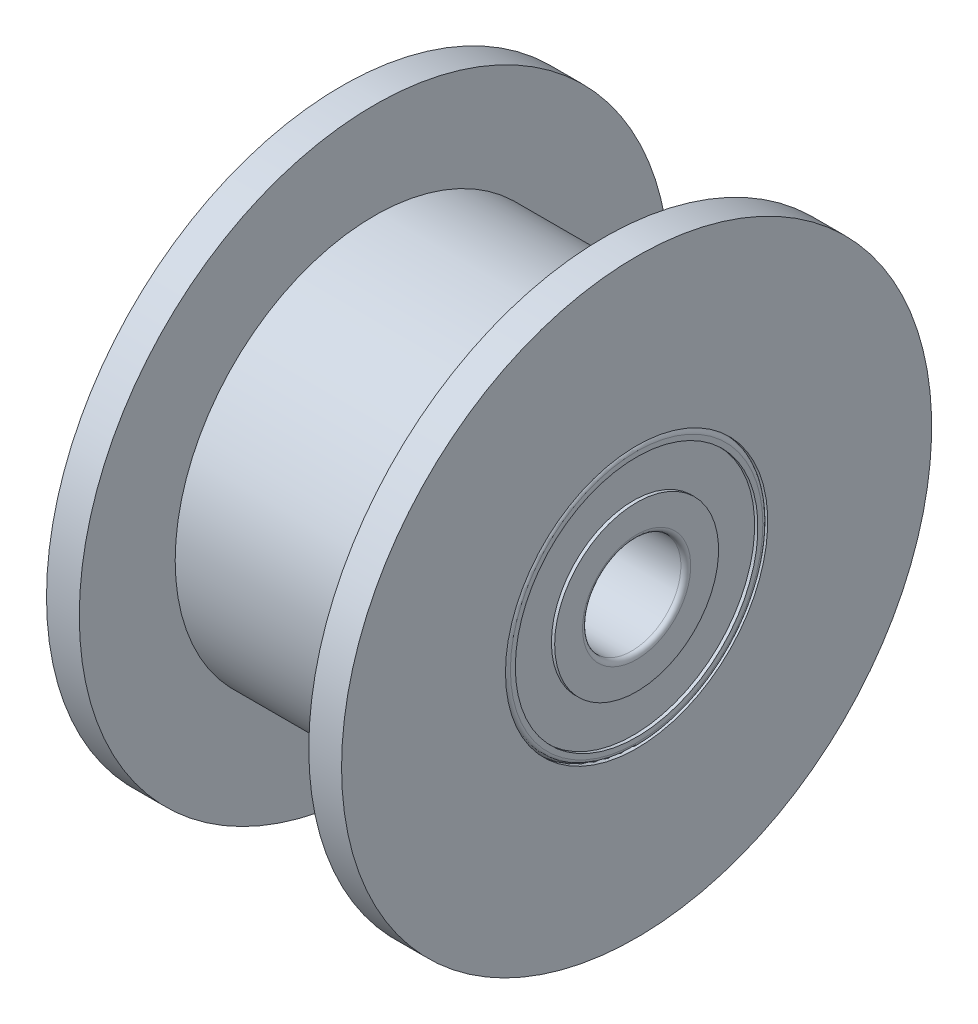
ISO-10303-21;
HEADER;
FILE_DESCRIPTION(('STEP AP214'),'2;1');
FILE_NAME('part.step','',(''),(''),'','','');
FILE_SCHEMA(('AUTOMOTIVE_DESIGN { 1 0 10303 214 1 1 1 1 }'));
ENDSEC;
DATA;
#1=APPLICATION_CONTEXT('core data for automotive mechanical design processes');
#2=APPLICATION_PROTOCOL_DEFINITION('international standard','automotive_design',2000,#1);
#3=PRODUCT_CONTEXT('',#1,'mechanical');
#4=PRODUCT('Part','Part','',(#3));
#5=PRODUCT_RELATED_PRODUCT_CATEGORY('part','',(#4));
#6=PRODUCT_DEFINITION_FORMATION('','',#4);
#7=PRODUCT_DEFINITION_CONTEXT('part definition',#1,'design');
#8=PRODUCT_DEFINITION('design','',#6,#7);
#9=PRODUCT_DEFINITION_SHAPE('','',#8);
#10=(LENGTH_UNIT() NAMED_UNIT(*) SI_UNIT(.MILLI.,.METRE.));
#11=(NAMED_UNIT(*) PLANE_ANGLE_UNIT() SI_UNIT($,.RADIAN.));
#12=(NAMED_UNIT(*) SI_UNIT($,.STERADIAN.) SOLID_ANGLE_UNIT());
#13=UNCERTAINTY_MEASURE_WITH_UNIT(LENGTH_MEASURE(1.E-05),#10,'distance_accuracy_value','');
#14=(GEOMETRIC_REPRESENTATION_CONTEXT(3) GLOBAL_UNCERTAINTY_ASSIGNED_CONTEXT((#13)) GLOBAL_UNIT_ASSIGNED_CONTEXT((#10,
#11,#12)) REPRESENTATION_CONTEXT('',''));
#15=CARTESIAN_POINT('',(0.,0.,0.));
#16=DIRECTION('',(0.,0.,1.));
#17=DIRECTION('',(1.,0.,0.));
#18=AXIS2_PLACEMENT_3D('',#15,#16,#17);
#19=CARTESIAN_POINT('',(-4.35,0.,0.));
#20=DIRECTION('',(1.,0.,0.));
#21=DIRECTION('',(0.,0.,1.));
#22=AXIS2_PLACEMENT_3D('',#19,#20,#21);
#23=TOROIDAL_SURFACE('',#22,1.65,0.15);
#24=CARTESIAN_POINT('',(-4.5,0.,0.));
#25=DIRECTION('',(-1.,0.,0.));
#26=DIRECTION('',(0.,0.,1.));
#27=AXIS2_PLACEMENT_3D('',#24,#25,#26);
#28=CIRCLE('',#27,1.65);
#29=CARTESIAN_POINT('',(-4.5,0.,1.65));
#30=VERTEX_POINT('',#29);
#31=EDGE_CURVE('E165',#30,#30,#28,.T.);
#32=ORIENTED_EDGE('',*,*,#31,.T.);
#33=EDGE_LOOP('',(#32));
#34=FACE_BOUND('',#33,.T.);
#35=CARTESIAN_POINT('',(-4.35,0.,0.));
#36=DIRECTION('',(1.,0.,0.));
#37=DIRECTION('',(0.,0.,1.));
#38=AXIS2_PLACEMENT_3D('',#35,#36,#37);
#39=CIRCLE('',#38,1.5);
#40=CARTESIAN_POINT('',(-4.35,0.,1.5));
#41=VERTEX_POINT('',#40);
#42=EDGE_CURVE('E162',#41,#41,#39,.T.);
#43=ORIENTED_EDGE('',*,*,#42,.T.);
#44=EDGE_LOOP('',(#43));
#45=FACE_BOUND('',#44,.T.);
#46=ADVANCED_FACE('F15',(#34,#45),#23,.T.);
#47=CARTESIAN_POINT('',(-4.5,0.,6.5));
#48=DIRECTION('',(1.,0.,0.));
#49=DIRECTION('',(0.,1.,0.));
#50=AXIS2_PLACEMENT_3D('',#47,#48,#49);
#51=PLANE('',#50);
#52=CARTESIAN_POINT('',(-4.5,0.,0.));
#53=DIRECTION('',(-1.,0.,0.));
#54=DIRECTION('',(0.,0.,1.));
#55=AXIS2_PLACEMENT_3D('',#52,#53,#54);
#56=CIRCLE('',#55,4.);
#57=CARTESIAN_POINT('',(-4.5,0.,4.));
#58=VERTEX_POINT('',#57);
#59=EDGE_CURVE('E10',#58,#58,#56,.T.);
#60=ORIENTED_EDGE('',*,*,#59,.F.);
#61=EDGE_LOOP('',(#60));
#62=FACE_BOUND('',#61,.T.);
#63=CARTESIAN_POINT('',(-4.5,0.,0.));
#64=DIRECTION('',(-1.,0.,0.));
#65=DIRECTION('',(0.,0.,1.));
#66=AXIS2_PLACEMENT_3D('',#63,#64,#65);
#67=CIRCLE('',#66,9.);
#68=CARTESIAN_POINT('',(-4.5,0.,9.));
#69=VERTEX_POINT('',#68);
#70=EDGE_CURVE('E193',#69,#69,#67,.T.);
#71=ORIENTED_EDGE('',*,*,#70,.T.);
#72=EDGE_LOOP('',(#71));
#73=FACE_BOUND('',#72,.T.);
#74=ADVANCED_FACE('F243',(#62,#73),#51,.F.);
#75=CARTESIAN_POINT('',(-2.25,0.,0.));
#76=DIRECTION('',(1.,0.,0.));
#77=DIRECTION('',(0.,0.,1.));
#78=AXIS2_PLACEMENT_3D('',#75,#76,#77);
#79=CYLINDRICAL_SURFACE('',#78,4.);
#80=CARTESIAN_POINT('',(-4.35,0.,0.));
#81=DIRECTION('',(-1.,0.,0.));
#82=DIRECTION('',(0.,0.,1.));
#83=AXIS2_PLACEMENT_3D('',#80,#81,#82);
#84=CIRCLE('',#83,4.);
#85=CARTESIAN_POINT('',(-4.35,0.,4.));
#86=VERTEX_POINT('',#85);
#87=EDGE_CURVE('E26',#86,#86,#84,.T.);
#88=ORIENTED_EDGE('',*,*,#87,.F.);
#89=EDGE_LOOP('',(#88));
#90=FACE_BOUND('',#89,.T.);
#91=ORIENTED_EDGE('',*,*,#59,.T.);
#92=EDGE_LOOP('',(#91));
#93=FACE_BOUND('',#92,.T.);
#94=ADVANCED_FACE('F232',(#90,#93),#79,.F.);
#95=CARTESIAN_POINT('',(-4.35,0.,0.));
#96=DIRECTION('',(1.,0.,0.));
#97=DIRECTION('',(0.,0.,1.));
#98=AXIS2_PLACEMENT_3D('',#95,#96,#97);
#99=TOROIDAL_SURFACE('',#98,3.85,0.15);
#100=ORIENTED_EDGE('',*,*,#87,.T.);
#101=EDGE_LOOP('',(#100));
#102=FACE_BOUND('',#101,.T.);
#103=CARTESIAN_POINT('',(-4.5,0.,0.));
#104=DIRECTION('',(-1.,0.,0.));
#105=DIRECTION('',(0.,0.,1.));
#106=AXIS2_PLACEMENT_3D('',#103,#104,#105);
#107=CIRCLE('',#106,3.85);
#108=CARTESIAN_POINT('',(-4.5,0.,3.85));
#109=VERTEX_POINT('',#108);
#110=EDGE_CURVE('E152',#109,#109,#107,.T.);
#111=ORIENTED_EDGE('',*,*,#110,.F.);
#112=EDGE_LOOP('',(#111));
#113=FACE_BOUND('',#112,.T.);
#114=ADVANCED_FACE('F230',(#102,#113),#99,.T.);
#115=CARTESIAN_POINT('',(-4.5,0.,3.775));
#116=DIRECTION('',(1.,0.,0.));
#117=DIRECTION('',(0.,1.,0.));
#118=AXIS2_PLACEMENT_3D('',#115,#116,#117);
#119=PLANE('',#118);
#120=CARTESIAN_POINT('',(-4.5,0.,0.));
#121=DIRECTION('',(-1.,0.,0.));
#122=DIRECTION('',(0.,0.,1.));
#123=AXIS2_PLACEMENT_3D('',#120,#121,#122);
#124=CIRCLE('',#123,3.7);
#125=CARTESIAN_POINT('',(-4.5,0.,3.7));
#126=VERTEX_POINT('',#125);
#127=EDGE_CURVE('E144',#126,#126,#124,.T.);
#128=ORIENTED_EDGE('',*,*,#127,.F.);
#129=EDGE_LOOP('',(#128));
#130=FACE_BOUND('',#129,.T.);
#131=ORIENTED_EDGE('',*,*,#110,.T.);
#132=EDGE_LOOP('',(#131));
#133=FACE_BOUND('',#132,.T.);
#134=ADVANCED_FACE('F228',(#130,#133),#119,.F.);
#135=CARTESIAN_POINT('',(-2.25,0.,0.));
#136=DIRECTION('',(1.,0.,0.));
#137=DIRECTION('',(0.,0.,1.));
#138=AXIS2_PLACEMENT_3D('',#135,#136,#137);
#139=CYLINDRICAL_SURFACE('',#138,3.7);
#140=CARTESIAN_POINT('',(-4.4,0.,0.));
#141=DIRECTION('',(-1.,0.,0.));
#142=DIRECTION('',(0.,0.,1.));
#143=AXIS2_PLACEMENT_3D('',#140,#141,#142);
#144=CIRCLE('',#143,3.7);
#145=CARTESIAN_POINT('',(-4.4,0.,3.7));
#146=VERTEX_POINT('',#145);
#147=EDGE_CURVE('E140',#146,#146,#144,.T.);
#148=ORIENTED_EDGE('',*,*,#147,.F.);
#149=EDGE_LOOP('',(#148));
#150=FACE_BOUND('',#149,.T.);
#151=ORIENTED_EDGE('',*,*,#127,.T.);
#152=EDGE_LOOP('',(#151));
#153=FACE_BOUND('',#152,.T.);
#154=ADVANCED_FACE('F240',(#150,#153),#139,.F.);
#155=CARTESIAN_POINT('',(-4.4,0.,3.1));
#156=DIRECTION('',(1.,0.,0.));
#157=DIRECTION('',(0.,1.,0.));
#158=AXIS2_PLACEMENT_3D('',#155,#156,#157);
#159=PLANE('',#158);
#160=CARTESIAN_POINT('',(-4.4,0.,0.));
#161=DIRECTION('',(-1.,0.,0.));
#162=DIRECTION('',(0.,0.,1.));
#163=AXIS2_PLACEMENT_3D('',#160,#161,#162);
#164=CIRCLE('',#163,2.5);
#165=CARTESIAN_POINT('',(-4.4,0.,2.5));
#166=VERTEX_POINT('',#165);
#167=EDGE_CURVE('E145',#166,#166,#164,.T.);
#168=ORIENTED_EDGE('',*,*,#167,.F.);
#169=EDGE_LOOP('',(#168));
#170=FACE_BOUND('',#169,.T.);
#171=ORIENTED_EDGE('',*,*,#147,.T.);
#172=EDGE_LOOP('',(#171));
#173=FACE_BOUND('',#172,.T.);
#174=ADVANCED_FACE('F141',(#170,#173),#159,.F.);
#175=CARTESIAN_POINT('',(-2.25,0.,0.));
#176=DIRECTION('',(1.,0.,0.));
#177=DIRECTION('',(0.,0.,1.));
#178=AXIS2_PLACEMENT_3D('',#175,#176,#177);
#179=CYLINDRICAL_SURFACE('',#178,2.5);
#180=CARTESIAN_POINT('',(-4.5,0.,0.));
#181=DIRECTION('',(-1.,0.,0.));
#182=DIRECTION('',(0.,0.,1.));
#183=AXIS2_PLACEMENT_3D('',#180,#181,#182);
#184=CIRCLE('',#183,2.5);
#185=CARTESIAN_POINT('',(-4.5,0.,2.5));
#186=VERTEX_POINT('',#185);
#187=EDGE_CURVE('E154',#186,#186,#184,.T.);
#188=ORIENTED_EDGE('',*,*,#187,.F.);
#189=EDGE_LOOP('',(#188));
#190=FACE_BOUND('',#189,.T.);
#191=ORIENTED_EDGE('',*,*,#167,.T.);
#192=EDGE_LOOP('',(#191));
#193=FACE_BOUND('',#192,.T.);
#194=ADVANCED_FACE('F271',(#190,#193),#179,.T.);
#195=CARTESIAN_POINT('',(-4.5,0.,2.));
#196=DIRECTION('',(1.,0.,0.));
#197=DIRECTION('',(0.,1.,0.));
#198=AXIS2_PLACEMENT_3D('',#195,#196,#197);
#199=PLANE('',#198);
#200=ORIENTED_EDGE('',*,*,#187,.T.);
#201=EDGE_LOOP('',(#200));
#202=FACE_BOUND('',#201,.T.);
#203=ORIENTED_EDGE('',*,*,#31,.F.);
#204=EDGE_LOOP('',(#203));
#205=FACE_BOUND('',#204,.T.);
#206=ADVANCED_FACE('F308',(#202,#205),#199,.F.);
#207=CARTESIAN_POINT('',(-2.25,0.,0.));
#208=DIRECTION('',(1.,0.,0.));
#209=DIRECTION('',(0.,0.,1.));
#210=AXIS2_PLACEMENT_3D('',#207,#208,#209);
#211=CYLINDRICAL_SURFACE('',#210,1.5);
#212=CARTESIAN_POINT('',(-1.5,0.,0.));
#213=DIRECTION('',(-1.,0.,0.));
#214=DIRECTION('',(0.,0.,1.));
#215=AXIS2_PLACEMENT_3D('',#212,#213,#214);
#216=CIRCLE('',#215,1.5);
#217=CARTESIAN_POINT('',(-1.5,0.,1.5));
#218=VERTEX_POINT('',#217);
#219=EDGE_CURVE('E166',#218,#218,#216,.T.);
#220=ORIENTED_EDGE('',*,*,#219,.F.);
#221=EDGE_LOOP('',(#220));
#222=FACE_BOUND('',#221,.T.);
#223=ORIENTED_EDGE('',*,*,#42,.F.);
#224=EDGE_LOOP('',(#223));
#225=FACE_BOUND('',#224,.T.);
#226=ADVANCED_FACE('F284',(#222,#225),#211,.F.);
#227=CARTESIAN_POINT('',(-1.5,0.,2.625));
#228=DIRECTION('',(1.,0.,0.));
#229=DIRECTION('',(0.,1.,0.));
#230=AXIS2_PLACEMENT_3D('',#227,#228,#229);
#231=PLANE('',#230);
#232=ORIENTED_EDGE('',*,*,#219,.T.);
#233=EDGE_LOOP('',(#232));
#234=FACE_BOUND('',#233,.T.);
#235=CARTESIAN_POINT('',(-1.5,0.,0.));
#236=DIRECTION('',(-1.,0.,0.));
#237=DIRECTION('',(0.,0.,1.));
#238=AXIS2_PLACEMENT_3D('',#235,#236,#237);
#239=CIRCLE('',#238,3.75);
#240=CARTESIAN_POINT('',(-1.5,0.,3.75));
#241=VERTEX_POINT('',#240);
#242=EDGE_CURVE('E170',#241,#241,#239,.T.);
#243=ORIENTED_EDGE('',*,*,#242,.F.);
#244=EDGE_LOOP('',(#243));
#245=FACE_BOUND('',#244,.T.);
#246=ADVANCED_FACE('F280',(#234,#245),#231,.T.);
#247=CARTESIAN_POINT('',(-3.5,0.,7.5375));
#248=DIRECTION('',(-1.,0.,0.));
#249=DIRECTION('',(0.,0.,1.));
#250=AXIS2_PLACEMENT_3D('',#247,#248,#249);
#251=PLANE('',#250);
#252=CARTESIAN_POINT('',(-3.5,0.,0.));
#253=DIRECTION('',(-1.,0.,0.));
#254=DIRECTION('',(0.,0.,1.));
#255=AXIS2_PLACEMENT_3D('',#252,#253,#254);
#256=CIRCLE('',#255,9.);
#257=CARTESIAN_POINT('',(-3.5,0.,9.));
#258=VERTEX_POINT('',#257);
#259=EDGE_CURVE('E190',#258,#258,#256,.T.);
#260=ORIENTED_EDGE('',*,*,#259,.F.);
#261=EDGE_LOOP('',(#260));
#262=FACE_BOUND('',#261,.T.);
#263=CARTESIAN_POINT('',(-3.5,0.,0.));
#264=DIRECTION('',(-1.,0.,0.));
#265=DIRECTION('',(0.,0.,1.));
#266=AXIS2_PLACEMENT_3D('',#263,#264,#265);
#267=CIRCLE('',#266,6.075);
#268=CARTESIAN_POINT('',(-3.5,0.,6.075));
#269=VERTEX_POINT('',#268);
#270=EDGE_CURVE('E222',#269,#269,#267,.T.);
#271=ORIENTED_EDGE('',*,*,#270,.T.);
#272=EDGE_LOOP('',(#271));
#273=FACE_BOUND('',#272,.T.);
#274=ADVANCED_FACE('F283',(#262,#273),#251,.F.);
#275=CARTESIAN_POINT('',(-2.25,0.,0.));
#276=DIRECTION('',(1.,0.,0.));
#277=DIRECTION('',(0.,0.,1.));
#278=AXIS2_PLACEMENT_3D('',#275,#276,#277);
#279=CYLINDRICAL_SURFACE('',#278,9.);
#280=ORIENTED_EDGE('',*,*,#70,.F.);
#281=EDGE_LOOP('',(#280));
#282=FACE_BOUND('',#281,.T.);
#283=ORIENTED_EDGE('',*,*,#259,.T.);
#284=EDGE_LOOP('',(#283));
#285=FACE_BOUND('',#284,.T.);
#286=ADVANCED_FACE('F287',(#282,#285),#279,.T.);
#287=CARTESIAN_POINT('',(4.35,0.,0.));
#288=DIRECTION('',(-1.,0.,0.));
#289=DIRECTION('',(0.,0.,1.));
#290=AXIS2_PLACEMENT_3D('',#287,#288,#289);
#291=TOROIDAL_SURFACE('',#290,1.65,0.15);
#292=CARTESIAN_POINT('',(4.5,0.,0.));
#293=DIRECTION('',(-1.,0.,0.));
#294=DIRECTION('',(0.,0.,1.));
#295=AXIS2_PLACEMENT_3D('',#292,#293,#294);
#296=CIRCLE('',#295,1.65);
#297=CARTESIAN_POINT('',(4.5,0.,1.65));
#298=VERTEX_POINT('',#297);
#299=EDGE_CURVE('E169',#298,#298,#296,.T.);
#300=ORIENTED_EDGE('',*,*,#299,.F.);
#301=EDGE_LOOP('',(#300));
#302=FACE_BOUND('',#301,.T.);
#303=CARTESIAN_POINT('',(4.35,0.,0.));
#304=DIRECTION('',(1.,0.,0.));
#305=DIRECTION('',(0.,0.,1.));
#306=AXIS2_PLACEMENT_3D('',#303,#304,#305);
#307=CIRCLE('',#306,1.5);
#308=CARTESIAN_POINT('',(4.35,0.,1.5));
#309=VERTEX_POINT('',#308);
#310=EDGE_CURVE('E186',#309,#309,#307,.T.);
#311=ORIENTED_EDGE('',*,*,#310,.F.);
#312=EDGE_LOOP('',(#311));
#313=FACE_BOUND('',#312,.T.);
#314=ADVANCED_FACE('F492',(#302,#313),#291,.T.);
#315=CARTESIAN_POINT('',(4.5,0.,6.5));
#316=DIRECTION('',(-1.,0.,0.));
#317=DIRECTION('',(0.,0.,1.));
#318=AXIS2_PLACEMENT_3D('',#315,#316,#317);
#319=PLANE('',#318);
#320=CARTESIAN_POINT('',(4.5,0.,0.));
#321=DIRECTION('',(-1.,0.,0.));
#322=DIRECTION('',(0.,0.,1.));
#323=AXIS2_PLACEMENT_3D('',#320,#321,#322);
#324=CIRCLE('',#323,4.);
#325=CARTESIAN_POINT('',(4.5,0.,4.));
#326=VERTEX_POINT('',#325);
#327=EDGE_CURVE('E187',#326,#326,#324,.T.);
#328=ORIENTED_EDGE('',*,*,#327,.T.);
#329=EDGE_LOOP('',(#328));
#330=FACE_BOUND('',#329,.T.);
#331=CARTESIAN_POINT('',(4.5,0.,0.));
#332=DIRECTION('',(-1.,0.,0.));
#333=DIRECTION('',(0.,0.,1.));
#334=AXIS2_PLACEMENT_3D('',#331,#332,#333);
#335=CIRCLE('',#334,9.);
#336=CARTESIAN_POINT('',(4.5,0.,9.));
#337=VERTEX_POINT('',#336);
#338=EDGE_CURVE('E179',#337,#337,#335,.T.);
#339=ORIENTED_EDGE('',*,*,#338,.F.);
#340=EDGE_LOOP('',(#339));
#341=FACE_BOUND('',#340,.T.);
#342=ADVANCED_FACE('F303',(#330,#341),#319,.F.);
#343=CARTESIAN_POINT('',(2.25,0.,0.));
#344=DIRECTION('',(-1.,0.,0.));
#345=DIRECTION('',(0.,0.,1.));
#346=AXIS2_PLACEMENT_3D('',#343,#344,#345);
#347=CYLINDRICAL_SURFACE('',#346,4.);
#348=CARTESIAN_POINT('',(4.35,0.,0.));
#349=DIRECTION('',(-1.,0.,0.));
#350=DIRECTION('',(0.,0.,1.));
#351=AXIS2_PLACEMENT_3D('',#348,#349,#350);
#352=CIRCLE('',#351,4.);
#353=CARTESIAN_POINT('',(4.35,0.,4.));
#354=VERTEX_POINT('',#353);
#355=EDGE_CURVE('E191',#354,#354,#352,.T.);
#356=ORIENTED_EDGE('',*,*,#355,.T.);
#357=EDGE_LOOP('',(#356));
#358=FACE_BOUND('',#357,.T.);
#359=ORIENTED_EDGE('',*,*,#327,.F.);
#360=EDGE_LOOP('',(#359));
#361=FACE_BOUND('',#360,.T.);
#362=ADVANCED_FACE('F261',(#358,#361),#347,.F.);
#363=CARTESIAN_POINT('',(4.35,0.,0.));
#364=DIRECTION('',(-1.,0.,0.));
#365=DIRECTION('',(0.,0.,1.));
#366=AXIS2_PLACEMENT_3D('',#363,#364,#365);
#367=TOROIDAL_SURFACE('',#366,3.85,0.15);
#368=ORIENTED_EDGE('',*,*,#355,.F.);
#369=EDGE_LOOP('',(#368));
#370=FACE_BOUND('',#369,.T.);
#371=CARTESIAN_POINT('',(4.5,0.,0.));
#372=DIRECTION('',(-1.,0.,0.));
#373=DIRECTION('',(0.,0.,1.));
#374=AXIS2_PLACEMENT_3D('',#371,#372,#373);
#375=CIRCLE('',#374,3.85);
#376=CARTESIAN_POINT('',(4.5,0.,3.85));
#377=VERTEX_POINT('',#376);
#378=EDGE_CURVE('E178',#377,#377,#375,.T.);
#379=ORIENTED_EDGE('',*,*,#378,.T.);
#380=EDGE_LOOP('',(#379));
#381=FACE_BOUND('',#380,.T.);
#382=ADVANCED_FACE('F257',(#370,#381),#367,.T.);
#383=CARTESIAN_POINT('',(4.5,0.,3.775));
#384=DIRECTION('',(-1.,0.,0.));
#385=DIRECTION('',(0.,0.,1.));
#386=AXIS2_PLACEMENT_3D('',#383,#384,#385);
#387=PLANE('',#386);
#388=CARTESIAN_POINT('',(4.5,0.,0.));
#389=DIRECTION('',(-1.,0.,0.));
#390=DIRECTION('',(0.,0.,1.));
#391=AXIS2_PLACEMENT_3D('',#388,#389,#390);
#392=CIRCLE('',#391,3.7);
#393=CARTESIAN_POINT('',(4.5,0.,3.7));
#394=VERTEX_POINT('',#393);
#395=EDGE_CURVE('E161',#394,#394,#392,.T.);
#396=ORIENTED_EDGE('',*,*,#395,.T.);
#397=EDGE_LOOP('',(#396));
#398=FACE_BOUND('',#397,.T.);
#399=ORIENTED_EDGE('',*,*,#378,.F.);
#400=EDGE_LOOP('',(#399));
#401=FACE_BOUND('',#400,.T.);
#402=ADVANCED_FACE('F260',(#398,#401),#387,.F.);
#403=CARTESIAN_POINT('',(2.25,0.,0.));
#404=DIRECTION('',(-1.,0.,0.));
#405=DIRECTION('',(0.,0.,1.));
#406=AXIS2_PLACEMENT_3D('',#403,#404,#405);
#407=CYLINDRICAL_SURFACE('',#406,3.7);
#408=CARTESIAN_POINT('',(4.4,0.,0.));
#409=DIRECTION('',(-1.,0.,0.));
#410=DIRECTION('',(0.,0.,1.));
#411=AXIS2_PLACEMENT_3D('',#408,#409,#410);
#412=CIRCLE('',#411,3.7);
#413=CARTESIAN_POINT('',(4.4,0.,3.7));
#414=VERTEX_POINT('',#413);
#415=EDGE_CURVE('E158',#414,#414,#412,.T.);
#416=ORIENTED_EDGE('',*,*,#415,.T.);
#417=EDGE_LOOP('',(#416));
#418=FACE_BOUND('',#417,.T.);
#419=ORIENTED_EDGE('',*,*,#395,.F.);
#420=EDGE_LOOP('',(#419));
#421=FACE_BOUND('',#420,.T.);
#422=ADVANCED_FACE('F17',(#418,#421),#407,.F.);
#423=CARTESIAN_POINT('',(4.4,0.,3.1));
#424=DIRECTION('',(-1.,0.,0.));
#425=DIRECTION('',(0.,0.,1.));
#426=AXIS2_PLACEMENT_3D('',#423,#424,#425);
#427=PLANE('',#426);
#428=CARTESIAN_POINT('',(4.4,0.,0.));
#429=DIRECTION('',(-1.,0.,0.));
#430=DIRECTION('',(0.,0.,1.));
#431=AXIS2_PLACEMENT_3D('',#428,#429,#430);
#432=CIRCLE('',#431,2.5);
#433=CARTESIAN_POINT('',(4.4,0.,2.5));
#434=VERTEX_POINT('',#433);
#435=EDGE_CURVE('E99',#434,#434,#432,.T.);
#436=ORIENTED_EDGE('',*,*,#435,.T.);
#437=EDGE_LOOP('',(#436));
#438=FACE_BOUND('',#437,.T.);
#439=ORIENTED_EDGE('',*,*,#415,.F.);
#440=EDGE_LOOP('',(#439));
#441=FACE_BOUND('',#440,.T.);
#442=ADVANCED_FACE('F273',(#438,#441),#427,.F.);
#443=CARTESIAN_POINT('',(2.25,0.,0.));
#444=DIRECTION('',(-1.,0.,0.));
#445=DIRECTION('',(0.,0.,1.));
#446=AXIS2_PLACEMENT_3D('',#443,#444,#445);
#447=CYLINDRICAL_SURFACE('',#446,2.5);
#448=CARTESIAN_POINT('',(4.5,0.,0.));
#449=DIRECTION('',(-1.,0.,0.));
#450=DIRECTION('',(0.,0.,1.));
#451=AXIS2_PLACEMENT_3D('',#448,#449,#450);
#452=CIRCLE('',#451,2.5);
#453=CARTESIAN_POINT('',(4.5,0.,2.5));
#454=VERTEX_POINT('',#453);
#455=EDGE_CURVE('E89',#454,#454,#452,.T.);
#456=ORIENTED_EDGE('',*,*,#455,.T.);
#457=EDGE_LOOP('',(#456));
#458=FACE_BOUND('',#457,.T.);
#459=ORIENTED_EDGE('',*,*,#435,.F.);
#460=EDGE_LOOP('',(#459));
#461=FACE_BOUND('',#460,.T.);
#462=ADVANCED_FACE('F276',(#458,#461),#447,.T.);
#463=CARTESIAN_POINT('',(4.5,0.,2.));
#464=DIRECTION('',(-1.,0.,0.));
#465=DIRECTION('',(0.,0.,1.));
#466=AXIS2_PLACEMENT_3D('',#463,#464,#465);
#467=PLANE('',#466);
#468=ORIENTED_EDGE('',*,*,#455,.F.);
#469=EDGE_LOOP('',(#468));
#470=FACE_BOUND('',#469,.T.);
#471=ORIENTED_EDGE('',*,*,#299,.T.);
#472=EDGE_LOOP('',(#471));
#473=FACE_BOUND('',#472,.T.);
#474=ADVANCED_FACE('F306',(#470,#473),#467,.F.);
#475=CARTESIAN_POINT('',(2.25,0.,0.));
#476=DIRECTION('',(-1.,0.,0.));
#477=DIRECTION('',(0.,0.,1.));
#478=AXIS2_PLACEMENT_3D('',#475,#476,#477);
#479=CYLINDRICAL_SURFACE('',#478,1.5);
#480=CARTESIAN_POINT('',(1.5,0.,0.));
#481=DIRECTION('',(-1.,0.,0.));
#482=DIRECTION('',(0.,0.,1.));
#483=AXIS2_PLACEMENT_3D('',#480,#481,#482);
#484=CIRCLE('',#483,1.5);
#485=CARTESIAN_POINT('',(1.5,0.,1.5));
#486=VERTEX_POINT('',#485);
#487=EDGE_CURVE('E173',#486,#486,#484,.T.);
#488=ORIENTED_EDGE('',*,*,#487,.T.);
#489=EDGE_LOOP('',(#488));
#490=FACE_BOUND('',#489,.T.);
#491=ORIENTED_EDGE('',*,*,#310,.T.);
#492=EDGE_LOOP('',(#491));
#493=FACE_BOUND('',#492,.T.);
#494=ADVANCED_FACE('F293',(#490,#493),#479,.F.);
#495=CARTESIAN_POINT('',(1.5,0.,2.625));
#496=DIRECTION('',(-1.,0.,0.));
#497=DIRECTION('',(0.,0.,1.));
#498=AXIS2_PLACEMENT_3D('',#495,#496,#497);
#499=PLANE('',#498);
#500=ORIENTED_EDGE('',*,*,#487,.F.);
#501=EDGE_LOOP('',(#500));
#502=FACE_BOUND('',#501,.T.);
#503=CARTESIAN_POINT('',(1.5,0.,0.));
#504=DIRECTION('',(-1.,0.,0.));
#505=DIRECTION('',(0.,0.,1.));
#506=AXIS2_PLACEMENT_3D('',#503,#504,#505);
#507=CIRCLE('',#506,3.75);
#508=CARTESIAN_POINT('',(1.5,0.,3.75));
#509=VERTEX_POINT('',#508);
#510=EDGE_CURVE('E174',#509,#509,#507,.T.);
#511=ORIENTED_EDGE('',*,*,#510,.T.);
#512=EDGE_LOOP('',(#511));
#513=FACE_BOUND('',#512,.T.);
#514=ADVANCED_FACE('F289',(#502,#513),#499,.T.);
#515=CARTESIAN_POINT('',(2.25,0.,0.));
#516=DIRECTION('',(-1.,0.,0.));
#517=DIRECTION('',(0.,0.,1.));
#518=AXIS2_PLACEMENT_3D('',#515,#516,#517);
#519=CYLINDRICAL_SURFACE('',#518,3.75);
#520=ORIENTED_EDGE('',*,*,#242,.T.);
#521=EDGE_LOOP('',(#520));
#522=FACE_BOUND('',#521,.T.);
#523=ORIENTED_EDGE('',*,*,#510,.F.);
#524=EDGE_LOOP('',(#523));
#525=FACE_BOUND('',#524,.T.);
#526=ADVANCED_FACE('F292',(#522,#525),#519,.F.);
#527=CARTESIAN_POINT('',(2.25,0.,0.));
#528=DIRECTION('',(-1.,0.,0.));
#529=DIRECTION('',(0.,0.,1.));
#530=AXIS2_PLACEMENT_3D('',#527,#528,#529);
#531=CYLINDRICAL_SURFACE('',#530,6.075);
#532=ORIENTED_EDGE('',*,*,#270,.F.);
#533=EDGE_LOOP('',(#532));
#534=FACE_BOUND('',#533,.T.);
#535=CARTESIAN_POINT('',(3.5,0.,0.));
#536=DIRECTION('',(-1.,0.,0.));
#537=DIRECTION('',(0.,0.,1.));
#538=AXIS2_PLACEMENT_3D('',#535,#536,#537);
#539=CIRCLE('',#538,6.075);
#540=CARTESIAN_POINT('',(3.5,0.,6.075));
#541=VERTEX_POINT('',#540);
#542=EDGE_CURVE('E19',#541,#541,#539,.T.);
#543=ORIENTED_EDGE('',*,*,#542,.T.);
#544=EDGE_LOOP('',(#543));
#545=FACE_BOUND('',#544,.T.);
#546=ADVANCED_FACE('F267',(#534,#545),#531,.T.);
#547=CARTESIAN_POINT('',(3.5,0.,7.5375));
#548=DIRECTION('',(1.,0.,0.));
#549=DIRECTION('',(0.,1.,0.));
#550=AXIS2_PLACEMENT_3D('',#547,#548,#549);
#551=PLANE('',#550);
#552=CARTESIAN_POINT('',(3.5,0.,0.));
#553=DIRECTION('',(-1.,0.,0.));
#554=DIRECTION('',(0.,0.,1.));
#555=AXIS2_PLACEMENT_3D('',#552,#553,#554);
#556=CIRCLE('',#555,9.);
#557=CARTESIAN_POINT('',(3.5,0.,9.));
#558=VERTEX_POINT('',#557);
#559=EDGE_CURVE('E183',#558,#558,#556,.T.);
#560=ORIENTED_EDGE('',*,*,#559,.T.);
#561=EDGE_LOOP('',(#560));
#562=FACE_BOUND('',#561,.T.);
#563=ORIENTED_EDGE('',*,*,#542,.F.);
#564=EDGE_LOOP('',(#563));
#565=FACE_BOUND('',#564,.T.);
#566=ADVANCED_FACE('F263',(#562,#565),#551,.F.);
#567=CARTESIAN_POINT('',(2.25,0.,0.));
#568=DIRECTION('',(-1.,0.,0.));
#569=DIRECTION('',(0.,0.,1.));
#570=AXIS2_PLACEMENT_3D('',#567,#568,#569);
#571=CYLINDRICAL_SURFACE('',#570,9.);
#572=ORIENTED_EDGE('',*,*,#338,.T.);
#573=EDGE_LOOP('',(#572));
#574=FACE_BOUND('',#573,.T.);
#575=ORIENTED_EDGE('',*,*,#559,.F.);
#576=EDGE_LOOP('',(#575));
#577=FACE_BOUND('',#576,.T.);
#578=ADVANCED_FACE('F266',(#574,#577),#571,.T.);
#579=CLOSED_SHELL('',(#46,#74,#94,#114,#134,#154,#174,#194,#206,#226,#246,#274,#286,#314,#342,
#362,#382,#402,#422,#442,#462,#474,#494,#514,#526,#546,#566,#578));
#580=MANIFOLD_SOLID_BREP('B1',#579);
#581=ADVANCED_BREP_SHAPE_REPRESENTATION('',(#18,#580),#14);
#582=SHAPE_DEFINITION_REPRESENTATION(#9,#581);
ENDSEC;
END-ISO-10303-21;
